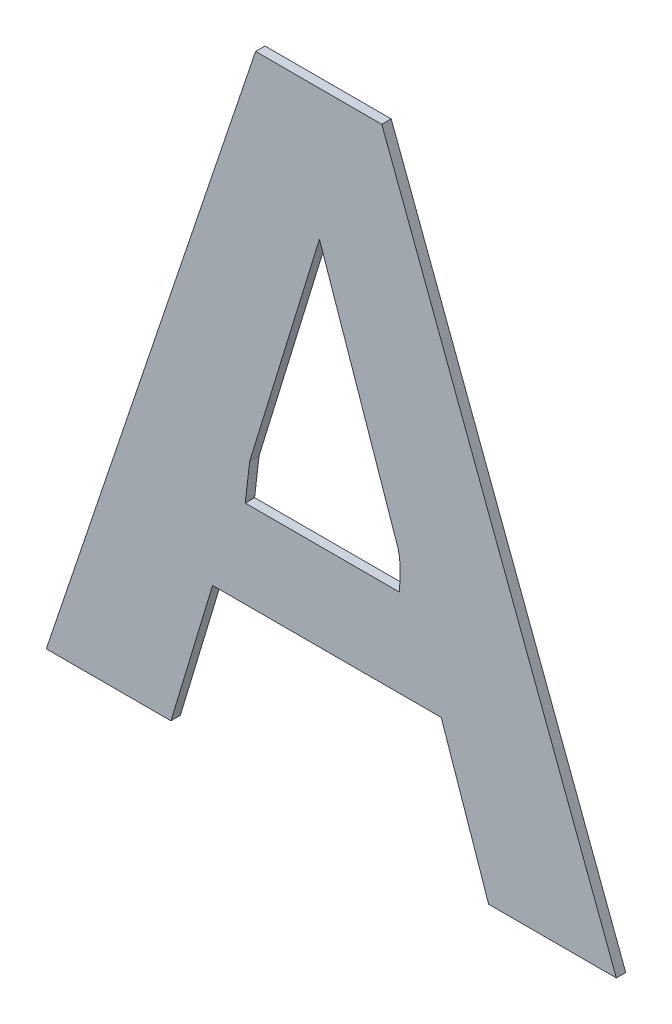
ISO-10303-21;
HEADER;
FILE_DESCRIPTION(('STEP AP214'),'2;1');
FILE_NAME('part.step','',(''),(''),'','','');
FILE_SCHEMA(('AUTOMOTIVE_DESIGN { 1 0 10303 214 1 1 1 1 }'));
ENDSEC;
DATA;
#1=APPLICATION_CONTEXT('core data for automotive mechanical design processes');
#2=APPLICATION_PROTOCOL_DEFINITION('international standard','automotive_design',2000,#1);
#3=PRODUCT_CONTEXT('',#1,'mechanical');
#4=PRODUCT('Part','Part','',(#3));
#5=PRODUCT_RELATED_PRODUCT_CATEGORY('part','',(#4));
#6=PRODUCT_DEFINITION_FORMATION('','',#4);
#7=PRODUCT_DEFINITION_CONTEXT('part definition',#1,'design');
#8=PRODUCT_DEFINITION('design','',#6,#7);
#9=PRODUCT_DEFINITION_SHAPE('','',#8);
#10=(LENGTH_UNIT() NAMED_UNIT(*) SI_UNIT(.MILLI.,.METRE.));
#11=(NAMED_UNIT(*) PLANE_ANGLE_UNIT() SI_UNIT($,.RADIAN.));
#12=(NAMED_UNIT(*) SI_UNIT($,.STERADIAN.) SOLID_ANGLE_UNIT());
#13=UNCERTAINTY_MEASURE_WITH_UNIT(LENGTH_MEASURE(1.E-05),#10,'distance_accuracy_value','');
#14=(GEOMETRIC_REPRESENTATION_CONTEXT(3) GLOBAL_UNCERTAINTY_ASSIGNED_CONTEXT((#13)) GLOBAL_UNIT_ASSIGNED_CONTEXT((#10,
#11,#12)) REPRESENTATION_CONTEXT('',''));
#15=CARTESIAN_POINT('',(0.,0.,0.));
#16=DIRECTION('',(0.,0.,1.));
#17=DIRECTION('',(1.,0.,0.));
#18=AXIS2_PLACEMENT_3D('',#15,#16,#17);
#19=CARTESIAN_POINT('',(2.9309934433956,-0.59286924549241,0.));
#20=DIRECTION('',(0.955988278716449,-0.293404858440961,0.));
#21=DIRECTION('',(0.293404858440961,0.955988278716449,0.));
#22=AXIS2_PLACEMENT_3D('',#19,#20,#21);
#23=PLANE('',#22);
#24=DIRECTION('',(0.293404858440961,0.955988278716449,0.));
#25=VECTOR('',#24,1.);
#26=CARTESIAN_POINT('',(2.9309934433956,-0.59286924549241,0.));
#27=LINE('',#26,#25);
#28=CARTESIAN_POINT('',(2.9309934433956,-0.59286924549241,0.));
#29=VERTEX_POINT('',#28);
#30=CARTESIAN_POINT('',(2.9532799404606,-0.520254122208619,0.));
#31=VERTEX_POINT('',#30);
#32=EDGE_CURVE('E11',#29,#31,#27,.T.);
#33=ORIENTED_EDGE('',*,*,#32,.T.);
#34=DIRECTION('',(0.,0.,1.));
#35=VECTOR('',#34,1.);
#36=CARTESIAN_POINT('',(2.9532799404606,-0.520254122208619,0.));
#37=LINE('',#36,#35);
#38=CARTESIAN_POINT('',(2.9532799404606,-0.520254122208619,0.003));
#39=VERTEX_POINT('',#38);
#40=EDGE_CURVE('E24',#31,#39,#37,.T.);
#41=ORIENTED_EDGE('',*,*,#40,.T.);
#42=DIRECTION('',(0.293404858440961,0.955988278716449,0.));
#43=VECTOR('',#42,1.);
#44=CARTESIAN_POINT('',(2.9309934433956,-0.59286924549241,0.003));
#45=LINE('',#44,#43);
#46=CARTESIAN_POINT('',(2.9309934433956,-0.59286924549241,0.003));
#47=VERTEX_POINT('',#46);
#48=EDGE_CURVE('E233',#47,#39,#45,.T.);
#49=ORIENTED_EDGE('',*,*,#48,.F.);
#50=DIRECTION('',(0.,0.,1.));
#51=VECTOR('',#50,1.);
#52=CARTESIAN_POINT('',(2.9309934433956,-0.59286924549241,0.));
#53=LINE('',#52,#51);
#54=EDGE_CURVE('E230',#29,#47,#53,.T.);
#55=ORIENTED_EDGE('',*,*,#54,.F.);
#56=EDGE_LOOP('',(#33,#41,#49,#55));
#57=FACE_BOUND('',#56,.T.);
#58=ADVANCED_FACE('F17',(#57),#23,.T.);
#59=CARTESIAN_POINT('',(2.9295497990071,-0.605183797362393,0.));
#60=DIRECTION('',(0.993198498677168,-0.116433424004534,0.));
#61=DIRECTION('',(0.116433424004534,0.993198498677168,0.));
#62=AXIS2_PLACEMENT_3D('',#59,#60,#61);
#63=PLANE('',#62);
#64=DIRECTION('',(0.116433424004534,0.993198498677168,0.));
#65=VECTOR('',#64,1.);
#66=CARTESIAN_POINT('',(2.9295497990071,-0.605183797362393,0.));
#67=LINE('',#66,#65);
#68=CARTESIAN_POINT('',(2.9295497990071,-0.605183797362393,0.));
#69=VERTEX_POINT('',#68);
#70=EDGE_CURVE('E227',#69,#29,#67,.T.);
#71=ORIENTED_EDGE('',*,*,#70,.T.);
#72=ORIENTED_EDGE('',*,*,#54,.T.);
#73=DIRECTION('',(0.116433424004534,0.993198498677168,0.));
#74=VECTOR('',#73,1.);
#75=CARTESIAN_POINT('',(2.9295497990071,-0.605183797362393,0.003));
#76=LINE('',#75,#74);
#77=CARTESIAN_POINT('',(2.9295497990071,-0.605183797362393,0.003));
#78=VERTEX_POINT('',#77);
#79=EDGE_CURVE('E224',#78,#47,#76,.T.);
#80=ORIENTED_EDGE('',*,*,#79,.F.);
#81=DIRECTION('',(0.,0.,1.));
#82=VECTOR('',#81,1.);
#83=CARTESIAN_POINT('',(2.9295497990071,-0.605183797362393,0.));
#84=LINE('',#83,#82);
#85=EDGE_CURVE('E221',#69,#78,#84,.T.);
#86=ORIENTED_EDGE('',*,*,#85,.F.);
#87=EDGE_LOOP('',(#71,#72,#80,#86));
#88=FACE_BOUND('',#87,.T.);
#89=ADVANCED_FACE('F246',(#88),#63,.T.);
#90=CARTESIAN_POINT('',(2.9789122065411,-0.605183797362393,0.));
#91=DIRECTION('',(0.,1.,0.));
#92=DIRECTION('',(-1.,0.,0.));
#93=AXIS2_PLACEMENT_3D('',#90,#91,#92);
#94=PLANE('',#93);
#95=DIRECTION('',(-1.,0.,0.));
#96=VECTOR('',#95,1.);
#97=CARTESIAN_POINT('',(2.9789122065411,-0.605183797362393,0.));
#98=LINE('',#97,#96);
#99=CARTESIAN_POINT('',(2.9789122065411,-0.605183797362393,0.));
#100=VERTEX_POINT('',#99);
#101=EDGE_CURVE('E218',#100,#69,#98,.T.);
#102=ORIENTED_EDGE('',*,*,#101,.T.);
#103=ORIENTED_EDGE('',*,*,#85,.T.);
#104=DIRECTION('',(-1.,0.,0.));
#105=VECTOR('',#104,1.);
#106=CARTESIAN_POINT('',(2.9789122065411,-0.605183797362393,0.003));
#107=LINE('',#106,#105);
#108=CARTESIAN_POINT('',(2.9789122065411,-0.605183797362393,0.003));
#109=VERTEX_POINT('',#108);
#110=EDGE_CURVE('E215',#109,#78,#107,.T.);
#111=ORIENTED_EDGE('',*,*,#110,.F.);
#112=DIRECTION('',(0.,0.,1.));
#113=VECTOR('',#112,1.);
#114=CARTESIAN_POINT('',(2.9789122065411,-0.605183797362393,0.));
#115=LINE('',#114,#113);
#116=EDGE_CURVE('E209',#100,#109,#115,.T.);
#117=ORIENTED_EDGE('',*,*,#116,.F.);
#118=EDGE_LOOP('',(#102,#103,#111,#117));
#119=FACE_BOUND('',#118,.T.);
#120=ADVANCED_FACE('F243',(#119),#94,.T.);
#121=CARTESIAN_POINT('',(2.9784309917449,-0.593327725731415,0.));
#122=CARTESIAN_POINT('',(2.9784309917449,-0.593327725731415,0.003));
#123=CARTESIAN_POINT('',(2.9793924742342,-0.597131974995988,0.));
#124=CARTESIAN_POINT('',(2.9793924742342,-0.597131974995988,0.003));
#125=CARTESIAN_POINT('',(2.9789122066804,-0.59855667390999,0.));
#126=CARTESIAN_POINT('',(2.9789122066804,-0.59855667390999,0.003));
#127=CARTESIAN_POINT('',(2.9789122065411,-0.605183797362393,0.));
#128=CARTESIAN_POINT('',(2.9789122065411,-0.605183797362393,0.003));
#129=B_SPLINE_SURFACE_WITH_KNOTS('',3,1,((#121,#122),(#123,#124),(#125,#126),(#127,#128)),
.UNSPECIFIED.,.F.,.F.,.F.,(4,4),(2,2),(0.,1.),(0.,0.0003),.UNSPECIFIED.);
#130=CARTESIAN_POINT('',(2.9784309917449,-0.593327725731415,0.));
#131=CARTESIAN_POINT('',(2.9793924742342,-0.597131974995988,0.));
#132=CARTESIAN_POINT('',(2.9789122066804,-0.59855667390999,0.));
#133=CARTESIAN_POINT('',(2.9789122065411,-0.605183797362393,0.));
#134=B_SPLINE_CURVE_WITH_KNOTS('',3,(#130,#131,#132,#133),.UNSPECIFIED.,.F.,.F.,(4,4),(0.,1.),.UNSPECIFIED.);
#135=CARTESIAN_POINT('',(2.9784309917449,-0.593327725731415,0.));
#136=VERTEX_POINT('',#135);
#137=EDGE_CURVE('E201',#136,#100,#134,.T.);
#138=CARTESIAN_POINT('',(2.9784309917449,-0.593327725731415,0.003));
#139=CARTESIAN_POINT('',(2.9793924742342,-0.597131974995988,0.003));
#140=CARTESIAN_POINT('',(2.9789122066804,-0.59855667390999,0.003));
#141=CARTESIAN_POINT('',(2.9789122065411,-0.605183797362393,0.003));
#142=B_SPLINE_CURVE_WITH_KNOTS('',3,(#138,#139,#140,#141),.UNSPECIFIED.,.F.,.F.,(4,4),(0.,1.),.UNSPECIFIED.);
#143=CARTESIAN_POINT('',(2.9784309917449,-0.593327725731415,0.003));
#144=VERTEX_POINT('',#143);
#145=EDGE_CURVE('E196',#144,#109,#142,.T.);
#146=DIRECTION('',(0.,0.,1.));
#147=VECTOR('',#146,1.);
#148=CARTESIAN_POINT('',(2.9784309917449,-0.593327725731415,0.));
#149=LINE('',#148,#147);
#150=EDGE_CURVE('E193',#136,#144,#149,.T.);
#151=ORIENTED_EDGE('',*,*,#137,.T.);
#152=ORIENTED_EDGE('',*,*,#116,.T.);
#153=ORIENTED_EDGE('',*,*,#145,.F.);
#154=ORIENTED_EDGE('',*,*,#150,.F.);
#155=EDGE_LOOP('',(#151,#152,#153,#154));
#156=FACE_BOUND('',#155,.T.);
#157=ADVANCED_FACE('F240',(#156),#129,.T.);
#158=CARTESIAN_POINT('',(2.9532799404606,-0.520254122208619,0.));
#159=DIRECTION('',(-0.945559230328353,-0.32545006059433,0.));
#160=DIRECTION('',(0.32545006059433,-0.945559230328353,0.));
#161=AXIS2_PLACEMENT_3D('',#158,#159,#160);
#162=PLANE('',#161);
#163=DIRECTION('',(0.32545006059433,-0.945559230328353,0.));
#164=VECTOR('',#163,1.);
#165=CARTESIAN_POINT('',(2.9532799404606,-0.520254122208619,0.));
#166=LINE('',#165,#164);
#167=EDGE_CURVE('E190',#31,#136,#166,.T.);
#168=ORIENTED_EDGE('',*,*,#167,.T.);
#169=ORIENTED_EDGE('',*,*,#150,.T.);
#170=DIRECTION('',(0.32545006059433,-0.945559230328353,0.));
#171=VECTOR('',#170,1.);
#172=CARTESIAN_POINT('',(2.9532799404606,-0.520254122208619,0.003));
#173=LINE('',#172,#171);
#174=EDGE_CURVE('E187',#39,#144,#173,.T.);
#175=ORIENTED_EDGE('',*,*,#174,.F.);
#176=ORIENTED_EDGE('',*,*,#40,.F.);
#177=EDGE_LOOP('',(#168,#169,#175,#176));
#178=FACE_BOUND('',#177,.T.);
#179=ADVANCED_FACE('F237',(#178),#162,.T.);
#180=CARTESIAN_POINT('',(2.932872833466,-0.478504002276747,0.));
#181=DIRECTION('',(-0.947781810602992,0.318919487473115,0.));
#182=DIRECTION('',(-0.318919487473115,-0.947781810602992,0.));
#183=AXIS2_PLACEMENT_3D('',#180,#181,#182);
#184=PLANE('',#183);
#185=DIRECTION('',(-0.318919487473115,-0.947781810602992,0.));
#186=VECTOR('',#185,1.);
#187=CARTESIAN_POINT('',(2.932872833466,-0.478504002276747,0.));
#188=LINE('',#187,#186);
#189=CARTESIAN_POINT('',(2.932872833466,-0.478504002276747,0.));
#190=VERTEX_POINT('',#189);
#191=CARTESIAN_POINT('',(2.8659678731568,-0.677335704041417,0.));
#192=VERTEX_POINT('',#191);
#193=EDGE_CURVE('E185',#190,#192,#188,.T.);
#194=ORIENTED_EDGE('',*,*,#193,.T.);
#195=DIRECTION('',(0.,0.,1.));
#196=VECTOR('',#195,1.);
#197=CARTESIAN_POINT('',(2.8659678731568,-0.677335704041417,0.));
#198=LINE('',#197,#196);
#199=CARTESIAN_POINT('',(2.8659678731568,-0.677335704041417,0.003));
#200=VERTEX_POINT('',#199);
#201=EDGE_CURVE('E183',#192,#200,#198,.T.);
#202=ORIENTED_EDGE('',*,*,#201,.T.);
#203=DIRECTION('',(-0.318919487473115,-0.947781810602992,0.));
#204=VECTOR('',#203,1.);
#205=CARTESIAN_POINT('',(2.932872833466,-0.478504002276747,0.003));
#206=LINE('',#205,#204);
#207=CARTESIAN_POINT('',(2.932872833466,-0.478504002276747,0.003));
#208=VERTEX_POINT('',#207);
#209=EDGE_CURVE('E133',#208,#200,#206,.T.);
#210=ORIENTED_EDGE('',*,*,#209,.F.);
#211=DIRECTION('',(0.,0.,1.));
#212=VECTOR('',#211,1.);
#213=CARTESIAN_POINT('',(2.932872833466,-0.478504002276747,0.));
#214=LINE('',#213,#212);
#215=EDGE_CURVE('E179',#190,#208,#214,.T.);
#216=ORIENTED_EDGE('',*,*,#215,.F.);
#217=EDGE_LOOP('',(#194,#202,#210,#216));
#218=FACE_BOUND('',#217,.T.);
#219=ADVANCED_FACE('F276',(#218),#184,.T.);
#220=CARTESIAN_POINT('',(2.9732058326595,-0.478504002276747,0.));
#221=DIRECTION('',(0.,1.,0.));
#222=DIRECTION('',(-1.,0.,0.));
#223=AXIS2_PLACEMENT_3D('',#220,#221,#222);
#224=PLANE('',#223);
#225=DIRECTION('',(-1.,0.,0.));
#226=VECTOR('',#225,1.);
#227=CARTESIAN_POINT('',(2.9732058326595,-0.478504002276747,0.));
#228=LINE('',#227,#226);
#229=CARTESIAN_POINT('',(2.9732058326595,-0.478504002276747,0.));
#230=VERTEX_POINT('',#229);
#231=EDGE_CURVE('E176',#230,#190,#228,.T.);
#232=ORIENTED_EDGE('',*,*,#231,.T.);
#233=ORIENTED_EDGE('',*,*,#215,.T.);
#234=DIRECTION('',(-1.,0.,0.));
#235=VECTOR('',#234,1.);
#236=CARTESIAN_POINT('',(2.9732058326595,-0.478504002276747,0.003));
#237=LINE('',#236,#235);
#238=CARTESIAN_POINT('',(2.9732058326595,-0.478504002276747,0.003));
#239=VERTEX_POINT('',#238);
#240=EDGE_CURVE('E174',#239,#208,#237,.T.);
#241=ORIENTED_EDGE('',*,*,#240,.F.);
#242=DIRECTION('',(0.,0.,1.));
#243=VECTOR('',#242,1.);
#244=CARTESIAN_POINT('',(2.9732058326595,-0.478504002276747,0.));
#245=LINE('',#244,#243);
#246=EDGE_CURVE('E171',#230,#239,#245,.T.);
#247=ORIENTED_EDGE('',*,*,#246,.F.);
#248=EDGE_LOOP('',(#232,#233,#241,#247));
#249=FACE_BOUND('',#248,.T.);
#250=ADVANCED_FACE('F279',(#249),#224,.T.);
#251=CARTESIAN_POINT('',(3.0481815608093,-0.677335704041417,0.));
#252=DIRECTION('',(0.935687346706649,0.352830255523916,0.));
#253=DIRECTION('',(-0.352830255523916,0.935687346706649,0.));
#254=AXIS2_PLACEMENT_3D('',#251,#252,#253);
#255=PLANE('',#254);
#256=DIRECTION('',(-0.352830255523916,0.935687346706649,0.));
#257=VECTOR('',#256,1.);
#258=CARTESIAN_POINT('',(3.0481815608093,-0.677335704041417,0.));
#259=LINE('',#258,#257);
#260=CARTESIAN_POINT('',(3.0481815608093,-0.677335704041417,0.));
#261=VERTEX_POINT('',#260);
#262=EDGE_CURVE('E168',#261,#230,#259,.T.);
#263=ORIENTED_EDGE('',*,*,#262,.T.);
#264=ORIENTED_EDGE('',*,*,#246,.T.);
#265=DIRECTION('',(-0.352830255523916,0.935687346706649,0.));
#266=VECTOR('',#265,1.);
#267=CARTESIAN_POINT('',(3.0481815608093,-0.677335704041417,0.003));
#268=LINE('',#267,#266);
#269=CARTESIAN_POINT('',(3.0481815608093,-0.677335704041417,0.003));
#270=VERTEX_POINT('',#269);
#271=EDGE_CURVE('E165',#270,#239,#268,.T.);
#272=ORIENTED_EDGE('',*,*,#271,.F.);
#273=DIRECTION('',(0.,0.,1.));
#274=VECTOR('',#273,1.);
#275=CARTESIAN_POINT('',(3.0481815608093,-0.677335704041417,0.));
#276=LINE('',#275,#274);
#277=EDGE_CURVE('E162',#261,#270,#276,.T.);
#278=ORIENTED_EDGE('',*,*,#277,.F.);
#279=EDGE_LOOP('',(#263,#264,#272,#278));
#280=FACE_BOUND('',#279,.T.);
#281=ADVANCED_FACE('F283',(#280),#255,.T.);
#282=CARTESIAN_POINT('',(3.0073673468196,-0.677335704041417,0.));
#283=DIRECTION('',(0.,-1.,0.));
#284=DIRECTION('',(1.,0.,0.));
#285=AXIS2_PLACEMENT_3D('',#282,#283,#284);
#286=PLANE('',#285);
#287=DIRECTION('',(1.,0.,0.));
#288=VECTOR('',#287,1.);
#289=CARTESIAN_POINT('',(3.0073673468196,-0.677335704041417,0.));
#290=LINE('',#289,#288);
#291=CARTESIAN_POINT('',(3.0073673468196,-0.677335704041417,0.));
#292=VERTEX_POINT('',#291);
#293=EDGE_CURVE('E159',#292,#261,#290,.T.);
#294=ORIENTED_EDGE('',*,*,#293,.T.);
#295=ORIENTED_EDGE('',*,*,#277,.T.);
#296=DIRECTION('',(1.,0.,0.));
#297=VECTOR('',#296,1.);
#298=CARTESIAN_POINT('',(3.0073673468196,-0.677335704041417,0.003));
#299=LINE('',#298,#297);
#300=CARTESIAN_POINT('',(3.0073673468196,-0.677335704041417,0.003));
#301=VERTEX_POINT('',#300);
#302=EDGE_CURVE('E156',#301,#270,#299,.T.);
#303=ORIENTED_EDGE('',*,*,#302,.F.);
#304=DIRECTION('',(0.,0.,1.));
#305=VECTOR('',#304,1.);
#306=CARTESIAN_POINT('',(3.0073673468196,-0.677335704041417,0.));
#307=LINE('',#306,#305);
#308=EDGE_CURVE('E153',#292,#301,#307,.T.);
#309=ORIENTED_EDGE('',*,*,#308,.F.);
#310=EDGE_LOOP('',(#294,#295,#303,#309));
#311=FACE_BOUND('',#310,.T.);
#312=ADVANCED_FACE('F287',(#311),#286,.T.);
#313=CARTESIAN_POINT('',(2.9922109752874,-0.633198455593453,0.));
#314=DIRECTION('',(-0.945790685009923,-0.324776815903568,0.));
#315=DIRECTION('',(0.324776815903568,-0.945790685009923,0.));
#316=AXIS2_PLACEMENT_3D('',#313,#314,#315);
#317=PLANE('',#316);
#318=DIRECTION('',(0.324776815903568,-0.945790685009923,0.));
#319=VECTOR('',#318,1.);
#320=CARTESIAN_POINT('',(2.9922109752874,-0.633198455593453,0.));
#321=LINE('',#320,#319);
#322=CARTESIAN_POINT('',(2.9922109752874,-0.633198455593453,0.));
#323=VERTEX_POINT('',#322);
#324=EDGE_CURVE('E150',#323,#292,#321,.T.);
#325=ORIENTED_EDGE('',*,*,#324,.T.);
#326=ORIENTED_EDGE('',*,*,#308,.T.);
#327=DIRECTION('',(0.324776815903568,-0.945790685009923,0.));
#328=VECTOR('',#327,1.);
#329=CARTESIAN_POINT('',(2.9922109752874,-0.633198455593453,0.003));
#330=LINE('',#329,#328);
#331=CARTESIAN_POINT('',(2.9922109752874,-0.633198455593453,0.003));
#332=VERTEX_POINT('',#331);
#333=EDGE_CURVE('E147',#332,#301,#330,.T.);
#334=ORIENTED_EDGE('',*,*,#333,.F.);
#335=DIRECTION('',(0.,0.,1.));
#336=VECTOR('',#335,1.);
#337=CARTESIAN_POINT('',(2.9922109752874,-0.633198455593453,0.));
#338=LINE('',#337,#336);
#339=EDGE_CURVE('E144',#323,#332,#338,.T.);
#340=ORIENTED_EDGE('',*,*,#339,.F.);
#341=EDGE_LOOP('',(#325,#326,#334,#340));
#342=FACE_BOUND('',#341,.T.);
#343=ADVANCED_FACE('F291',(#342),#317,.T.);
#344=CARTESIAN_POINT('',(2.9191155844806,-0.633198455593453,0.));
#345=DIRECTION('',(0.,-1.,0.));
#346=DIRECTION('',(1.,0.,0.));
#347=AXIS2_PLACEMENT_3D('',#344,#345,#346);
#348=PLANE('',#347);
#349=DIRECTION('',(1.,0.,0.));
#350=VECTOR('',#349,1.);
#351=CARTESIAN_POINT('',(2.9191155844806,-0.633198455593453,0.));
#352=LINE('',#351,#350);
#353=CARTESIAN_POINT('',(2.9191155844806,-0.633198455593453,0.));
#354=VERTEX_POINT('',#353);
#355=EDGE_CURVE('E141',#354,#323,#352,.T.);
#356=ORIENTED_EDGE('',*,*,#355,.T.);
#357=ORIENTED_EDGE('',*,*,#339,.T.);
#358=DIRECTION('',(1.,0.,0.));
#359=VECTOR('',#358,1.);
#360=CARTESIAN_POINT('',(2.9191155844806,-0.633198455593453,0.003));
#361=LINE('',#360,#359);
#362=CARTESIAN_POINT('',(2.9191155844806,-0.633198455593453,0.003));
#363=VERTEX_POINT('',#362);
#364=EDGE_CURVE('E139',#363,#332,#361,.T.);
#365=ORIENTED_EDGE('',*,*,#364,.F.);
#366=DIRECTION('',(0.,0.,1.));
#367=VECTOR('',#366,1.);
#368=CARTESIAN_POINT('',(2.9191155844806,-0.633198455593453,0.));
#369=LINE('',#368,#367);
#370=EDGE_CURVE('E115',#354,#363,#369,.T.);
#371=ORIENTED_EDGE('',*,*,#370,.F.);
#372=EDGE_LOOP('',(#356,#357,#365,#371));
#373=FACE_BOUND('',#372,.T.);
#374=ADVANCED_FACE('F295',(#373),#348,.T.);
#375=CARTESIAN_POINT('',(2.9058196575541,-0.677335704041417,0.));
#376=DIRECTION('',(0.957498753383218,-0.288437406155277,0.));
#377=DIRECTION('',(0.288437406155277,0.957498753383218,0.));
#378=AXIS2_PLACEMENT_3D('',#375,#376,#377);
#379=PLANE('',#378);
#380=DIRECTION('',(0.288437406155277,0.957498753383218,0.));
#381=VECTOR('',#380,1.);
#382=CARTESIAN_POINT('',(2.9058196575541,-0.677335704041417,0.));
#383=LINE('',#382,#381);
#384=CARTESIAN_POINT('',(2.9058196575541,-0.677335704041417,0.));
#385=VERTEX_POINT('',#384);
#386=EDGE_CURVE('E119',#385,#354,#383,.T.);
#387=ORIENTED_EDGE('',*,*,#386,.T.);
#388=ORIENTED_EDGE('',*,*,#370,.T.);
#389=DIRECTION('',(0.288437406155277,0.957498753383218,0.));
#390=VECTOR('',#389,1.);
#391=CARTESIAN_POINT('',(2.9058196575541,-0.677335704041417,0.003));
#392=LINE('',#391,#390);
#393=CARTESIAN_POINT('',(2.9058196575541,-0.677335704041417,0.003));
#394=VERTEX_POINT('',#393);
#395=EDGE_CURVE('E108',#394,#363,#392,.T.);
#396=ORIENTED_EDGE('',*,*,#395,.F.);
#397=DIRECTION('',(0.,0.,1.));
#398=VECTOR('',#397,1.);
#399=CARTESIAN_POINT('',(2.9058196575541,-0.677335704041417,0.));
#400=LINE('',#399,#398);
#401=EDGE_CURVE('E112',#385,#394,#400,.T.);
#402=ORIENTED_EDGE('',*,*,#401,.F.);
#403=EDGE_LOOP('',(#387,#388,#396,#402));
#404=FACE_BOUND('',#403,.T.);
#405=ADVANCED_FACE('F111',(#404),#379,.T.);
#406=CARTESIAN_POINT('',(2.8659678731568,-0.677335704041417,0.));
#407=DIRECTION('',(0.,-1.,0.));
#408=DIRECTION('',(1.,0.,0.));
#409=AXIS2_PLACEMENT_3D('',#406,#407,#408);
#410=PLANE('',#409);
#411=DIRECTION('',(1.,0.,0.));
#412=VECTOR('',#411,1.);
#413=CARTESIAN_POINT('',(2.8659678731568,-0.677335704041417,0.));
#414=LINE('',#413,#412);
#415=EDGE_CURVE('E127',#192,#385,#414,.T.);
#416=ORIENTED_EDGE('',*,*,#415,.T.);
#417=ORIENTED_EDGE('',*,*,#401,.T.);
#418=DIRECTION('',(1.,0.,0.));
#419=VECTOR('',#418,1.);
#420=CARTESIAN_POINT('',(2.8659678731568,-0.677335704041417,0.003));
#421=LINE('',#420,#419);
#422=EDGE_CURVE('E125',#200,#394,#421,.T.);
#423=ORIENTED_EDGE('',*,*,#422,.F.);
#424=ORIENTED_EDGE('',*,*,#201,.F.);
#425=EDGE_LOOP('',(#416,#417,#423,#424));
#426=FACE_BOUND('',#425,.T.);
#427=ADVANCED_FACE('F123',(#426),#410,.T.);
#428=CARTESIAN_POINT('',(2.957074716983,-0.577919853159082,0.003));
#429=DIRECTION('',(0.,0.,1.));
#430=DIRECTION('',(1.,0.,0.));
#431=AXIS2_PLACEMENT_3D('',#428,#429,#430);
#432=PLANE('',#431);
#433=ORIENTED_EDGE('',*,*,#422,.T.);
#434=ORIENTED_EDGE('',*,*,#395,.T.);
#435=ORIENTED_EDGE('',*,*,#364,.T.);
#436=ORIENTED_EDGE('',*,*,#333,.T.);
#437=ORIENTED_EDGE('',*,*,#302,.T.);
#438=ORIENTED_EDGE('',*,*,#271,.T.);
#439=ORIENTED_EDGE('',*,*,#240,.T.);
#440=ORIENTED_EDGE('',*,*,#209,.T.);
#441=EDGE_LOOP('',(#433,#434,#435,#436,#437,#438,#439,#440));
#442=FACE_BOUND('',#441,.T.);
#443=ORIENTED_EDGE('',*,*,#174,.T.);
#444=ORIENTED_EDGE('',*,*,#145,.T.);
#445=ORIENTED_EDGE('',*,*,#110,.T.);
#446=ORIENTED_EDGE('',*,*,#79,.T.);
#447=ORIENTED_EDGE('',*,*,#48,.T.);
#448=EDGE_LOOP('',(#443,#444,#445,#446,#447));
#449=FACE_BOUND('',#448,.T.);
#450=ADVANCED_FACE('F130',(#442,#449),#432,.T.);
#451=CARTESIAN_POINT('',(2.957074716983,-0.577919853159082,0.));
#452=DIRECTION('',(0.,0.,1.));
#453=DIRECTION('',(1.,0.,0.));
#454=AXIS2_PLACEMENT_3D('',#451,#452,#453);
#455=PLANE('',#454);
#456=ORIENTED_EDGE('',*,*,#415,.F.);
#457=ORIENTED_EDGE('',*,*,#193,.F.);
#458=ORIENTED_EDGE('',*,*,#231,.F.);
#459=ORIENTED_EDGE('',*,*,#262,.F.);
#460=ORIENTED_EDGE('',*,*,#293,.F.);
#461=ORIENTED_EDGE('',*,*,#324,.F.);
#462=ORIENTED_EDGE('',*,*,#355,.F.);
#463=ORIENTED_EDGE('',*,*,#386,.F.);
#464=EDGE_LOOP('',(#456,#457,#458,#459,#460,#461,#462,#463));
#465=FACE_BOUND('',#464,.T.);
#466=ORIENTED_EDGE('',*,*,#167,.F.);
#467=ORIENTED_EDGE('',*,*,#32,.F.);
#468=ORIENTED_EDGE('',*,*,#70,.F.);
#469=ORIENTED_EDGE('',*,*,#101,.F.);
#470=ORIENTED_EDGE('',*,*,#137,.F.);
#471=EDGE_LOOP('',(#466,#467,#468,#469,#470));
#472=FACE_BOUND('',#471,.T.);
#473=ADVANCED_FACE('F247',(#465,#472),#455,.F.);
#474=CLOSED_SHELL('',(#58,#89,#120,#157,#179,#219,#250,#281,#312,#343,#374,#405,#427,#450,#473));
#475=MANIFOLD_SOLID_BREP('B1',#474);
#476=ADVANCED_BREP_SHAPE_REPRESENTATION('',(#18,#475),#14);
#477=SHAPE_DEFINITION_REPRESENTATION(#9,#476);
ENDSEC;
END-ISO-10303-21;
